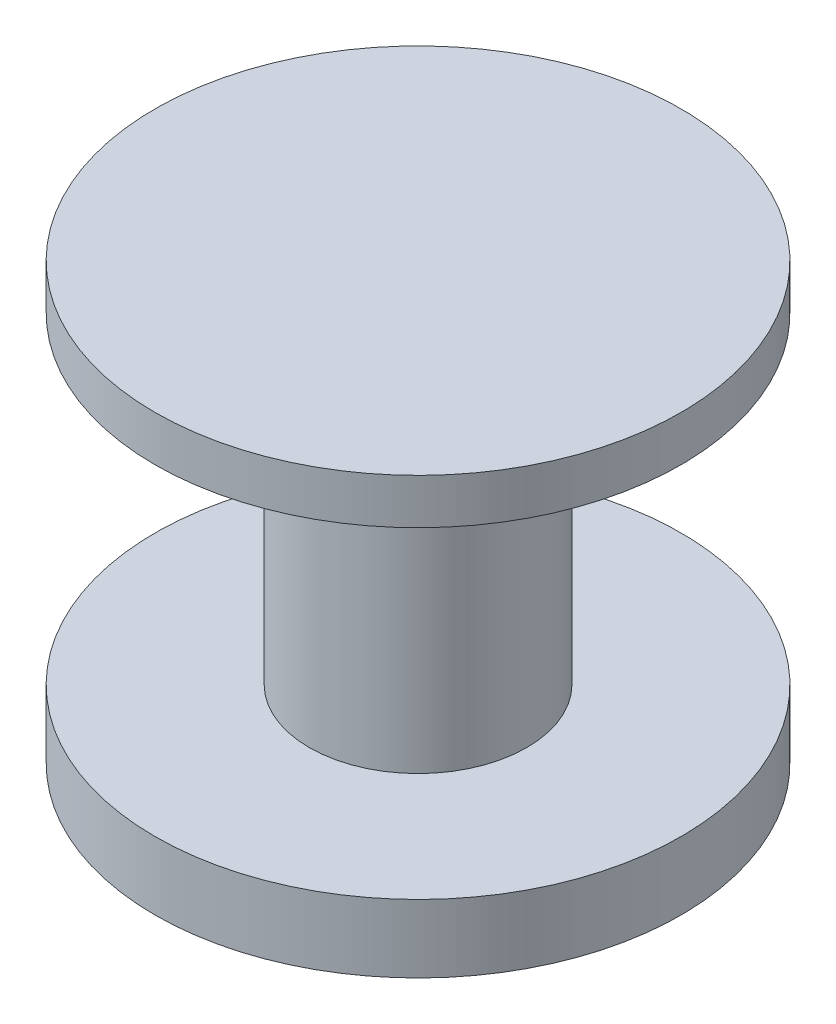
ISO-10303-21;
HEADER;
FILE_DESCRIPTION(('STEP AP214'),'2;1');
FILE_NAME('part.step','',(''),(''),'','','');
FILE_SCHEMA(('AUTOMOTIVE_DESIGN { 1 0 10303 214 1 1 1 1 }'));
ENDSEC;
DATA;
#1=APPLICATION_CONTEXT('core data for automotive mechanical design processes');
#2=APPLICATION_PROTOCOL_DEFINITION('international standard','automotive_design',2000,#1);
#3=PRODUCT_CONTEXT('',#1,'mechanical');
#4=PRODUCT('Part','Part','',(#3));
#5=PRODUCT_RELATED_PRODUCT_CATEGORY('part','',(#4));
#6=PRODUCT_DEFINITION_FORMATION('','',#4);
#7=PRODUCT_DEFINITION_CONTEXT('part definition',#1,'design');
#8=PRODUCT_DEFINITION('design','',#6,#7);
#9=PRODUCT_DEFINITION_SHAPE('','',#8);
#10=(LENGTH_UNIT() NAMED_UNIT(*) SI_UNIT(.MILLI.,.METRE.));
#11=(NAMED_UNIT(*) PLANE_ANGLE_UNIT() SI_UNIT($,.RADIAN.));
#12=(NAMED_UNIT(*) SI_UNIT($,.STERADIAN.) SOLID_ANGLE_UNIT());
#13=UNCERTAINTY_MEASURE_WITH_UNIT(LENGTH_MEASURE(1.E-05),#10,'distance_accuracy_value','');
#14=(GEOMETRIC_REPRESENTATION_CONTEXT(3) GLOBAL_UNCERTAINTY_ASSIGNED_CONTEXT((#13)) GLOBAL_UNIT_ASSIGNED_CONTEXT((#10,
#11,#12)) REPRESENTATION_CONTEXT('',''));
#15=CARTESIAN_POINT('',(0.,0.,0.));
#16=DIRECTION('',(0.,0.,1.));
#17=DIRECTION('',(1.,0.,0.));
#18=AXIS2_PLACEMENT_3D('',#15,#16,#17);
#19=CARTESIAN_POINT('',(0.,0.75,0.));
#20=DIRECTION('',(0.,-1.,0.));
#21=DIRECTION('',(0.,0.,-1.));
#22=AXIS2_PLACEMENT_3D('',#19,#20,#21);
#23=CYLINDRICAL_SURFACE('',#22,2.9);
#24=CARTESIAN_POINT('',(0.,0.75,0.));
#25=DIRECTION('',(0.,1.,0.));
#26=DIRECTION('',(0.,0.,1.));
#27=AXIS2_PLACEMENT_3D('',#24,#25,#26);
#28=CIRCLE('',#27,2.9);
#29=CARTESIAN_POINT('',(0.,0.75,2.9));
#30=VERTEX_POINT('',#29);
#31=EDGE_CURVE('E50',#30,#30,#28,.T.);
#32=ORIENTED_EDGE('',*,*,#31,.F.);
#33=EDGE_LOOP('',(#32));
#34=FACE_BOUND('',#33,.T.);
#35=CARTESIAN_POINT('',(0.,0.,0.));
#36=DIRECTION('',(0.,1.,0.));
#37=DIRECTION('',(0.,0.,1.));
#38=AXIS2_PLACEMENT_3D('',#35,#36,#37);
#39=CIRCLE('',#38,2.9);
#40=CARTESIAN_POINT('',(0.,0.,2.9));
#41=VERTEX_POINT('',#40);
#42=EDGE_CURVE('E46',#41,#41,#39,.T.);
#43=ORIENTED_EDGE('',*,*,#42,.T.);
#44=EDGE_LOOP('',(#43));
#45=FACE_BOUND('',#44,.T.);
#46=ADVANCED_FACE('F43',(#34,#45),#23,.T.);
#47=CARTESIAN_POINT('',(0.,0.75,0.));
#48=DIRECTION('',(0.,1.,0.));
#49=DIRECTION('',(0.,0.,1.));
#50=AXIS2_PLACEMENT_3D('',#47,#48,#49);
#51=PLANE('',#50);
#52=CARTESIAN_POINT('',(0.,0.75,0.));
#53=DIRECTION('',(0.,1.,0.));
#54=DIRECTION('',(0.,0.,1.));
#55=AXIS2_PLACEMENT_3D('',#52,#53,#54);
#56=CIRCLE('',#55,1.2);
#57=CARTESIAN_POINT('',(0.,0.75,1.2));
#58=VERTEX_POINT('',#57);
#59=EDGE_CURVE('E10',#58,#58,#56,.T.);
#60=ORIENTED_EDGE('',*,*,#59,.F.);
#61=EDGE_LOOP('',(#60));
#62=FACE_BOUND('',#61,.T.);
#63=ORIENTED_EDGE('',*,*,#31,.T.);
#64=EDGE_LOOP('',(#63));
#65=FACE_BOUND('',#64,.T.);
#66=ADVANCED_FACE('F84',(#62,#65),#51,.T.);
#67=CARTESIAN_POINT('',(0.,0.,0.));
#68=DIRECTION('',(0.,1.,0.));
#69=DIRECTION('',(0.,0.,1.));
#70=AXIS2_PLACEMENT_3D('',#67,#68,#69);
#71=PLANE('',#70);
#72=ORIENTED_EDGE('',*,*,#42,.F.);
#73=EDGE_LOOP('',(#72));
#74=FACE_BOUND('',#73,.T.);
#75=ADVANCED_FACE('F90',(#74),#71,.F.);
#76=CARTESIAN_POINT('',(0.,4.3,0.));
#77=DIRECTION('',(0.,-1.,0.));
#78=DIRECTION('',(0.,0.,-1.));
#79=AXIS2_PLACEMENT_3D('',#76,#77,#78);
#80=CYLINDRICAL_SURFACE('',#79,1.2);
#81=CARTESIAN_POINT('',(0.,4.3,0.));
#82=DIRECTION('',(0.,1.,0.));
#83=DIRECTION('',(0.,0.,1.));
#84=AXIS2_PLACEMENT_3D('',#81,#82,#83);
#85=CIRCLE('',#84,1.2);
#86=CARTESIAN_POINT('',(0.,4.3,1.2));
#87=VERTEX_POINT('',#86);
#88=EDGE_CURVE('E56',#87,#87,#85,.T.);
#89=ORIENTED_EDGE('',*,*,#88,.F.);
#90=EDGE_LOOP('',(#89));
#91=FACE_BOUND('',#90,.T.);
#92=ORIENTED_EDGE('',*,*,#59,.T.);
#93=EDGE_LOOP('',(#92));
#94=FACE_BOUND('',#93,.T.);
#95=ADVANCED_FACE('F71',(#91,#94),#80,.T.);
#96=CARTESIAN_POINT('',(0.,4.8,0.));
#97=DIRECTION('',(0.,-1.,0.));
#98=DIRECTION('',(0.,0.,-1.));
#99=AXIS2_PLACEMENT_3D('',#96,#97,#98);
#100=CYLINDRICAL_SURFACE('',#99,2.9);
#101=CARTESIAN_POINT('',(0.,4.8,0.));
#102=DIRECTION('',(0.,1.,0.));
#103=DIRECTION('',(0.,0.,1.));
#104=AXIS2_PLACEMENT_3D('',#101,#102,#103);
#105=CIRCLE('',#104,2.9);
#106=CARTESIAN_POINT('',(0.,4.8,2.9));
#107=VERTEX_POINT('',#106);
#108=EDGE_CURVE('E59',#107,#107,#105,.T.);
#109=ORIENTED_EDGE('',*,*,#108,.F.);
#110=EDGE_LOOP('',(#109));
#111=FACE_BOUND('',#110,.T.);
#112=CARTESIAN_POINT('',(0.,4.3,0.));
#113=DIRECTION('',(0.,1.,0.));
#114=DIRECTION('',(0.,0.,1.));
#115=AXIS2_PLACEMENT_3D('',#112,#113,#114);
#116=CIRCLE('',#115,2.9);
#117=CARTESIAN_POINT('',(0.,4.3,2.9));
#118=VERTEX_POINT('',#117);
#119=EDGE_CURVE('E60',#118,#118,#116,.T.);
#120=ORIENTED_EDGE('',*,*,#119,.T.);
#121=EDGE_LOOP('',(#120));
#122=FACE_BOUND('',#121,.T.);
#123=ADVANCED_FACE('F68',(#111,#122),#100,.T.);
#124=CARTESIAN_POINT('',(0.,4.8,0.));
#125=DIRECTION('',(0.,1.,0.));
#126=DIRECTION('',(0.,0.,1.));
#127=AXIS2_PLACEMENT_3D('',#124,#125,#126);
#128=PLANE('',#127);
#129=ORIENTED_EDGE('',*,*,#108,.T.);
#130=EDGE_LOOP('',(#129));
#131=FACE_BOUND('',#130,.T.);
#132=ADVANCED_FACE('F66',(#131),#128,.T.);
#133=CARTESIAN_POINT('',(0.,4.3,0.));
#134=DIRECTION('',(0.,1.,0.));
#135=DIRECTION('',(0.,0.,1.));
#136=AXIS2_PLACEMENT_3D('',#133,#134,#135);
#137=PLANE('',#136);
#138=ORIENTED_EDGE('',*,*,#88,.T.);
#139=EDGE_LOOP('',(#138));
#140=FACE_BOUND('',#139,.T.);
#141=ORIENTED_EDGE('',*,*,#119,.F.);
#142=EDGE_LOOP('',(#141));
#143=FACE_BOUND('',#142,.T.);
#144=ADVANCED_FACE('F75',(#140,#143),#137,.F.);
#145=CLOSED_SHELL('',(#46,#66,#75,#95,#123,#132,#144));
#146=MANIFOLD_SOLID_BREP('B2',#145);
#147=ADVANCED_BREP_SHAPE_REPRESENTATION('',(#18,#146),#14);
#148=SHAPE_DEFINITION_REPRESENTATION(#9,#147);
ENDSEC;
END-ISO-10303-21;
